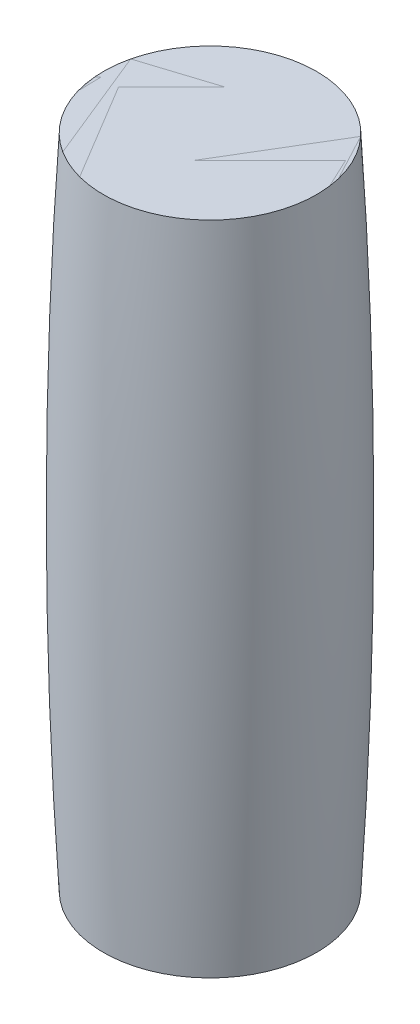
ISO-10303-21;
HEADER;
FILE_DESCRIPTION(('STEP AP214'),'2;1');
FILE_NAME('part.step','',(''),(''),'','','');
FILE_SCHEMA(('AUTOMOTIVE_DESIGN { 1 0 10303 214 1 1 1 1 }'));
ENDSEC;
DATA;
#1=APPLICATION_CONTEXT('core data for automotive mechanical design processes');
#2=APPLICATION_PROTOCOL_DEFINITION('international standard','automotive_design',2000,#1);
#3=PRODUCT_CONTEXT('',#1,'mechanical');
#4=PRODUCT('Part','Part','',(#3));
#5=PRODUCT_RELATED_PRODUCT_CATEGORY('part','',(#4));
#6=PRODUCT_DEFINITION_FORMATION('','',#4);
#7=PRODUCT_DEFINITION_CONTEXT('part definition',#1,'design');
#8=PRODUCT_DEFINITION('design','',#6,#7);
#9=PRODUCT_DEFINITION_SHAPE('','',#8);
#10=(LENGTH_UNIT() NAMED_UNIT(*) SI_UNIT(.MILLI.,.METRE.));
#11=(NAMED_UNIT(*) PLANE_ANGLE_UNIT() SI_UNIT($,.RADIAN.));
#12=(NAMED_UNIT(*) SI_UNIT($,.STERADIAN.) SOLID_ANGLE_UNIT());
#13=UNCERTAINTY_MEASURE_WITH_UNIT(LENGTH_MEASURE(1.E-05),#10,'distance_accuracy_value','');
#14=(GEOMETRIC_REPRESENTATION_CONTEXT(3) GLOBAL_UNCERTAINTY_ASSIGNED_CONTEXT((#13)) GLOBAL_UNIT_ASSIGNED_CONTEXT((#10,
#11,#12)) REPRESENTATION_CONTEXT('',''));
#15=CARTESIAN_POINT('',(0.,0.,0.));
#16=DIRECTION('',(0.,0.,1.));
#17=DIRECTION('',(1.,0.,0.));
#18=AXIS2_PLACEMENT_3D('',#15,#16,#17);
#19=CARTESIAN_POINT('',(0.,583.847763108503,0.));
#20=DIRECTION('',(0.,-1.,0.));
#21=DIRECTION('',(0.,0.,-1.));
#22=AXIS2_PLACEMENT_3D('',#19,#20,#21);
#23=CYLINDRICAL_SURFACE('',#22,64.9999999999999);
#24=CARTESIAN_POINT('',(0.,400.,0.));
#25=DIRECTION('',(0.,-1.,0.));
#26=DIRECTION('',(0.,0.,-1.));
#27=AXIS2_PLACEMENT_3D('',#24,#25,#26);
#28=CIRCLE('',#27,64.9999999999999);
#29=CARTESIAN_POINT('',(0.,400.,-64.9999999999999));
#30=VERTEX_POINT('',#29);
#31=EDGE_CURVE('E11',#30,#30,#28,.F.);
#32=ORIENTED_EDGE('',*,*,#31,.F.);
#33=EDGE_LOOP('',(#32));
#34=FACE_BOUND('',#33,.T.);
#35=CARTESIAN_POINT('',(0.,0.,0.));
#36=DIRECTION('',(0.,-1.,0.));
#37=DIRECTION('',(0.,0.,-1.));
#38=AXIS2_PLACEMENT_3D('',#35,#36,#37);
#39=CIRCLE('',#38,64.9999999999999);
#40=CARTESIAN_POINT('',(0.,0.,-64.9999999999999));
#41=VERTEX_POINT('',#40);
#42=EDGE_CURVE('E51',#41,#41,#39,.T.);
#43=ORIENTED_EDGE('',*,*,#42,.F.);
#44=EDGE_LOOP('',(#43));
#45=FACE_BOUND('',#44,.T.);
#46=ADVANCED_FACE('F45',(#34,#45),#23,.T.);
#47=CARTESIAN_POINT('',(0.,0.,0.));
#48=DIRECTION('',(0.,-1.,0.));
#49=DIRECTION('',(0.,0.,-1.));
#50=AXIS2_PLACEMENT_3D('',#47,#48,#49);
#51=PLANE('',#50);
#52=ORIENTED_EDGE('',*,*,#42,.T.);
#53=EDGE_LOOP('',(#52));
#54=FACE_BOUND('',#53,.T.);
#55=ADVANCED_FACE('F57',(#54),#51,.T.);
#56=CARTESIAN_POINT('',(-65.,400.,0.));
#57=DIRECTION('',(0.,-1.,0.));
#58=DIRECTION('',(0.,0.,-1.));
#59=AXIS2_PLACEMENT_3D('',#56,#57,#58);
#60=PLANE('',#59);
#61=ORIENTED_EDGE('',*,*,#31,.T.);
#62=EDGE_LOOP('',(#61));
#63=FACE_BOUND('',#62,.T.);
#64=ADVANCED_FACE('F64',(#63),#60,.F.);
#65=CLOSED_SHELL('',(#46,#55,#64));
#66=MANIFOLD_SOLID_BREP('B2_NOT_SHOWN',#65);
#67=CARTESIAN_POINT('',(-65.,400.,0.));
#68=DIRECTION('',(0.,-1.,0.));
#69=DIRECTION('',(0.,0.,-1.));
#70=AXIS2_PLACEMENT_3D('',#67,#68,#69);
#71=PLANE('',#70);
#72=CARTESIAN_POINT('',(0.,400.000000000001,0.));
#73=DIRECTION('',(0.,-1.,0.));
#74=DIRECTION('',(0.,0.,-1.));
#75=AXIS2_PLACEMENT_3D('',#72,#73,#74);
#76=CIRCLE('',#75,64.9999999999999);
#77=CARTESIAN_POINT('',(0.,400.000000000001,-64.9999999999999));
#78=VERTEX_POINT('',#77);
#79=EDGE_CURVE('E44',#78,#78,#76,.T.);
#80=ORIENTED_EDGE('',*,*,#79,.F.);
#81=EDGE_LOOP('',(#80));
#82=FACE_BOUND('',#81,.T.);
#83=ADVANCED_FACE('F86',(#82),#71,.F.);
#84=CARTESIAN_POINT('',(0.,200.,0.));
#85=DIRECTION('',(0.,-1.,0.));
#86=DIRECTION('',(0.,0.,-1.));
#87=AXIS2_PLACEMENT_3D('',#84,#85,#86);
#88=DEGENERATE_TOROIDAL_SURFACE('',#87,3528.51418068683,3599.07546000321,.F.);
#89=CARTESIAN_POINT('',(0.,0.,0.));
#90=DIRECTION('',(0.,-1.,0.));
#91=DIRECTION('',(0.,0.,-1.));
#92=AXIS2_PLACEMENT_3D('',#89,#90,#91);
#93=CIRCLE('',#92,65.);
#94=CARTESIAN_POINT('',(0.,0.,-65.));
#95=VERTEX_POINT('',#94);
#96=EDGE_CURVE('E92',#95,#95,#93,.T.);
#97=ORIENTED_EDGE('',*,*,#96,.F.);
#98=EDGE_LOOP('',(#97));
#99=FACE_BOUND('',#98,.T.);
#100=ORIENTED_EDGE('',*,*,#79,.T.);
#101=EDGE_LOOP('',(#100));
#102=FACE_BOUND('',#101,.T.);
#103=ADVANCED_FACE('F100',(#99,#102),#88,.F.);
#104=CARTESIAN_POINT('',(0.,0.,0.));
#105=DIRECTION('',(0.,1.,0.));
#106=DIRECTION('',(0.,0.,1.));
#107=AXIS2_PLACEMENT_3D('',#104,#105,#106);
#108=PLANE('',#107);
#109=ORIENTED_EDGE('',*,*,#96,.T.);
#110=EDGE_LOOP('',(#109));
#111=FACE_BOUND('',#110,.T.);
#112=ADVANCED_FACE('F98',(#111),#108,.F.);
#113=CLOSED_SHELL('',(#83,#103,#112));
#114=MANIFOLD_SOLID_BREP('B6',#113);
#115=ADVANCED_BREP_SHAPE_REPRESENTATION('',(#18,#66,#114),#14);
#116=SHAPE_DEFINITION_REPRESENTATION(#9,#115);
ENDSEC;
END-ISO-10303-21;
